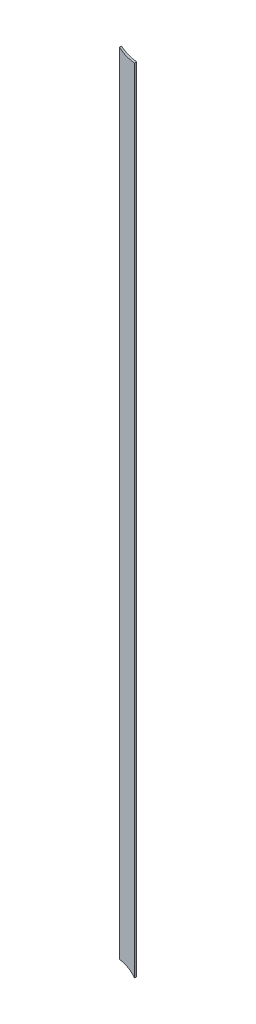
ISO-10303-21;
HEADER;
FILE_DESCRIPTION(('STEP AP214'),'2;1');
FILE_NAME('part.step','',(''),(''),'','','');
FILE_SCHEMA(('AUTOMOTIVE_DESIGN { 1 0 10303 214 1 1 1 1 }'));
ENDSEC;
DATA;
#1=APPLICATION_CONTEXT('core data for automotive mechanical design processes');
#2=APPLICATION_PROTOCOL_DEFINITION('international standard','automotive_design',2000,#1);
#3=PRODUCT_CONTEXT('',#1,'mechanical');
#4=PRODUCT('Part','Part','',(#3));
#5=PRODUCT_RELATED_PRODUCT_CATEGORY('part','',(#4));
#6=PRODUCT_DEFINITION_FORMATION('','',#4);
#7=PRODUCT_DEFINITION_CONTEXT('part definition',#1,'design');
#8=PRODUCT_DEFINITION('design','',#6,#7);
#9=PRODUCT_DEFINITION_SHAPE('','',#8);
#10=(LENGTH_UNIT() NAMED_UNIT(*) SI_UNIT(.MILLI.,.METRE.));
#11=(NAMED_UNIT(*) PLANE_ANGLE_UNIT() SI_UNIT($,.RADIAN.));
#12=(NAMED_UNIT(*) SI_UNIT($,.STERADIAN.) SOLID_ANGLE_UNIT());
#13=UNCERTAINTY_MEASURE_WITH_UNIT(LENGTH_MEASURE(1.E-05),#10,'distance_accuracy_value','');
#14=(GEOMETRIC_REPRESENTATION_CONTEXT(3) GLOBAL_UNCERTAINTY_ASSIGNED_CONTEXT((#13)) GLOBAL_UNIT_ASSIGNED_CONTEXT((#10,
#11,#12)) REPRESENTATION_CONTEXT('',''));
#15=CARTESIAN_POINT('',(0.,0.,0.));
#16=DIRECTION('',(0.,0.,1.));
#17=DIRECTION('',(1.,0.,0.));
#18=AXIS2_PLACEMENT_3D('',#15,#16,#17);
#19=CARTESIAN_POINT('',(88.90397764,73.7969239490096,0.));
#20=DIRECTION('',(-1.,0.,0.));
#21=DIRECTION('',(0.,1.,0.));
#22=AXIS2_PLACEMENT_3D('',#19,#20,#21);
#23=PLANE('',#22);
#24=DIRECTION('',(0.,1.,0.));
#25=VECTOR('',#24,1.);
#26=CARTESIAN_POINT('',(88.90397764,73.74697722,0.03556));
#27=LINE('',#26,#25);
#28=CARTESIAN_POINT('',(88.90397764,73.7969239490096,0.03556));
#29=VERTEX_POINT('',#28);
#30=CARTESIAN_POINT('',(88.90397764,87.1381852836317,0.03556));
#31=VERTEX_POINT('',#30);
#32=EDGE_CURVE('E11',#29,#31,#27,.T.);
#33=ORIENTED_EDGE('',*,*,#32,.F.);
#34=DIRECTION('',(0.,0.,1.));
#35=VECTOR('',#34,1.);
#36=CARTESIAN_POINT('',(88.90397764,73.7969239490096,0.));
#37=LINE('',#36,#35);
#38=CARTESIAN_POINT('',(88.90397764,73.7969239490096,0.));
#39=VERTEX_POINT('',#38);
#40=EDGE_CURVE('E24',#39,#29,#37,.T.);
#41=ORIENTED_EDGE('',*,*,#40,.F.);
#42=DIRECTION('',(0.,1.,0.));
#43=VECTOR('',#42,1.);
#44=CARTESIAN_POINT('',(88.90397764,73.74697722,0.));
#45=LINE('',#44,#43);
#46=CARTESIAN_POINT('',(88.90397764,87.1381852836317,0.));
#47=VERTEX_POINT('',#46);
#48=EDGE_CURVE('E75',#39,#47,#45,.T.);
#49=ORIENTED_EDGE('',*,*,#48,.T.);
#50=DIRECTION('',(0.,0.,1.));
#51=VECTOR('',#50,1.);
#52=CARTESIAN_POINT('',(88.90397764,87.1381852836317,0.));
#53=LINE('',#52,#51);
#54=EDGE_CURVE('E37',#47,#31,#53,.T.);
#55=ORIENTED_EDGE('',*,*,#54,.T.);
#56=EDGE_LOOP('',(#33,#41,#49,#55));
#57=FACE_BOUND('',#56,.T.);
#58=ADVANCED_FACE('F17',(#57),#23,.F.);
#59=CARTESIAN_POINT('',(88.9369824,87.5869724,0.));
#60=DIRECTION('',(0.,0.,-1.));
#61=DIRECTION('',(1.,0.,0.));
#62=AXIS2_PLACEMENT_3D('',#59,#60,#61);
#63=CYLINDRICAL_SURFACE('',#62,0.4499991);
#64=DIRECTION('',(0.,0.,1.));
#65=VECTOR('',#64,1.);
#66=CARTESIAN_POINT('',(88.64997764,87.2403783179124,0.));
#67=LINE('',#66,#65);
#68=CARTESIAN_POINT('',(88.64997764,87.2403783179124,0.));
#69=VERTEX_POINT('',#68);
#70=CARTESIAN_POINT('',(88.64997764,87.2403783179124,0.03556));
#71=VERTEX_POINT('',#70);
#72=EDGE_CURVE('E67',#69,#71,#67,.T.);
#73=ORIENTED_EDGE('',*,*,#72,.T.);
#74=CARTESIAN_POINT('',(88.9369824,87.5869724,0.03556));
#75=DIRECTION('',(0.,0.,1.));
#76=DIRECTION('',(1.,0.,0.));
#77=AXIS2_PLACEMENT_3D('',#74,#75,#76);
#78=CIRCLE('',#77,0.4499991);
#79=EDGE_CURVE('E82',#71,#31,#78,.T.);
#80=ORIENTED_EDGE('',*,*,#79,.T.);
#81=ORIENTED_EDGE('',*,*,#54,.F.);
#82=CARTESIAN_POINT('',(88.9369824,87.5869724,0.));
#83=DIRECTION('',(0.,0.,1.));
#84=DIRECTION('',(1.,0.,0.));
#85=AXIS2_PLACEMENT_3D('',#82,#83,#84);
#86=CIRCLE('',#85,0.4499991);
#87=EDGE_CURVE('E80',#69,#47,#86,.T.);
#88=ORIENTED_EDGE('',*,*,#87,.F.);
#89=EDGE_LOOP('',(#73,#80,#81,#88));
#90=FACE_BOUND('',#89,.T.);
#91=ADVANCED_FACE('F88',(#90),#63,.F.);
#92=CARTESIAN_POINT('',(88.64997764,87.2403783179124,0.));
#93=DIRECTION('',(1.,0.,0.));
#94=DIRECTION('',(0.,-1.,0.));
#95=AXIS2_PLACEMENT_3D('',#92,#93,#94);
#96=PLANE('',#95);
#97=DIRECTION('',(0.,-1.,0.));
#98=VECTOR('',#97,1.);
#99=CARTESIAN_POINT('',(88.64997764,87.42696764,0.03556));
#100=LINE('',#99,#98);
#101=CARTESIAN_POINT('',(88.64997764,73.9410374904921,0.03556));
#102=VERTEX_POINT('',#101);
#103=EDGE_CURVE('E71',#71,#102,#100,.T.);
#104=ORIENTED_EDGE('',*,*,#103,.F.);
#105=ORIENTED_EDGE('',*,*,#72,.F.);
#106=DIRECTION('',(0.,-1.,0.));
#107=VECTOR('',#106,1.);
#108=CARTESIAN_POINT('',(88.64997764,87.42696764,0.));
#109=LINE('',#108,#107);
#110=CARTESIAN_POINT('',(88.64997764,73.9410374904921,0.));
#111=VERTEX_POINT('',#110);
#112=EDGE_CURVE('E63',#69,#111,#109,.T.);
#113=ORIENTED_EDGE('',*,*,#112,.T.);
#114=DIRECTION('',(0.,0.,1.));
#115=VECTOR('',#114,1.);
#116=CARTESIAN_POINT('',(88.64997764,73.9410374904921,0.));
#117=LINE('',#116,#115);
#118=EDGE_CURVE('E53',#111,#102,#117,.T.);
#119=ORIENTED_EDGE('',*,*,#118,.T.);
#120=EDGE_LOOP('',(#104,#105,#113,#119));
#121=FACE_BOUND('',#120,.T.);
#122=ADVANCED_FACE('F66',(#121),#96,.F.);
#123=CARTESIAN_POINT('',(88.61697288,73.58697246,0.));
#124=DIRECTION('',(0.,0.,-1.));
#125=DIRECTION('',(1.,0.,0.));
#126=AXIS2_PLACEMENT_3D('',#123,#124,#125);
#127=CYLINDRICAL_SURFACE('',#126,0.3556);
#128=ORIENTED_EDGE('',*,*,#40,.T.);
#129=CARTESIAN_POINT('',(88.61697288,73.58697246,0.03556));
#130=DIRECTION('',(0.,0.,1.));
#131=DIRECTION('',(1.,0.,0.));
#132=AXIS2_PLACEMENT_3D('',#129,#130,#131);
#133=CIRCLE('',#132,0.3556);
#134=EDGE_CURVE('E59',#29,#102,#133,.T.);
#135=ORIENTED_EDGE('',*,*,#134,.T.);
#136=ORIENTED_EDGE('',*,*,#118,.F.);
#137=CARTESIAN_POINT('',(88.61697288,73.58697246,0.));
#138=DIRECTION('',(0.,0.,1.));
#139=DIRECTION('',(1.,0.,0.));
#140=AXIS2_PLACEMENT_3D('',#137,#138,#139);
#141=CIRCLE('',#140,0.3556);
#142=EDGE_CURVE('E57',#39,#111,#141,.T.);
#143=ORIENTED_EDGE('',*,*,#142,.F.);
#144=EDGE_LOOP('',(#128,#135,#136,#143));
#145=FACE_BOUND('',#144,.T.);
#146=ADVANCED_FACE('F55',(#145),#127,.F.);
#147=CARTESIAN_POINT('',(88.90397764,73.74697722,0.));
#148=DIRECTION('',(0.,0.,-1.));
#149=DIRECTION('',(-1.,0.,0.));
#150=AXIS2_PLACEMENT_3D('',#147,#148,#149);
#151=PLANE('',#150);
#152=ORIENTED_EDGE('',*,*,#48,.F.);
#153=ORIENTED_EDGE('',*,*,#142,.T.);
#154=ORIENTED_EDGE('',*,*,#112,.F.);
#155=ORIENTED_EDGE('',*,*,#87,.T.);
#156=EDGE_LOOP('',(#152,#153,#154,#155));
#157=FACE_BOUND('',#156,.T.);
#158=ADVANCED_FACE('F74',(#157),#151,.T.);
#159=CARTESIAN_POINT('',(88.90397764,73.74697722,0.03556));
#160=DIRECTION('',(0.,0.,-1.));
#161=DIRECTION('',(-1.,0.,0.));
#162=AXIS2_PLACEMENT_3D('',#159,#160,#161);
#163=PLANE('',#162);
#164=ORIENTED_EDGE('',*,*,#134,.F.);
#165=ORIENTED_EDGE('',*,*,#32,.T.);
#166=ORIENTED_EDGE('',*,*,#79,.F.);
#167=ORIENTED_EDGE('',*,*,#103,.T.);
#168=EDGE_LOOP('',(#164,#165,#166,#167));
#169=FACE_BOUND('',#168,.T.);
#170=ADVANCED_FACE('F91',(#169),#163,.F.);
#171=CLOSED_SHELL('',(#58,#91,#122,#146,#158,#170));
#172=MANIFOLD_SOLID_BREP('B1',#171);
#173=ADVANCED_BREP_SHAPE_REPRESENTATION('',(#18,#172),#14);
#174=SHAPE_DEFINITION_REPRESENTATION(#9,#173);
ENDSEC;
END-ISO-10303-21;
